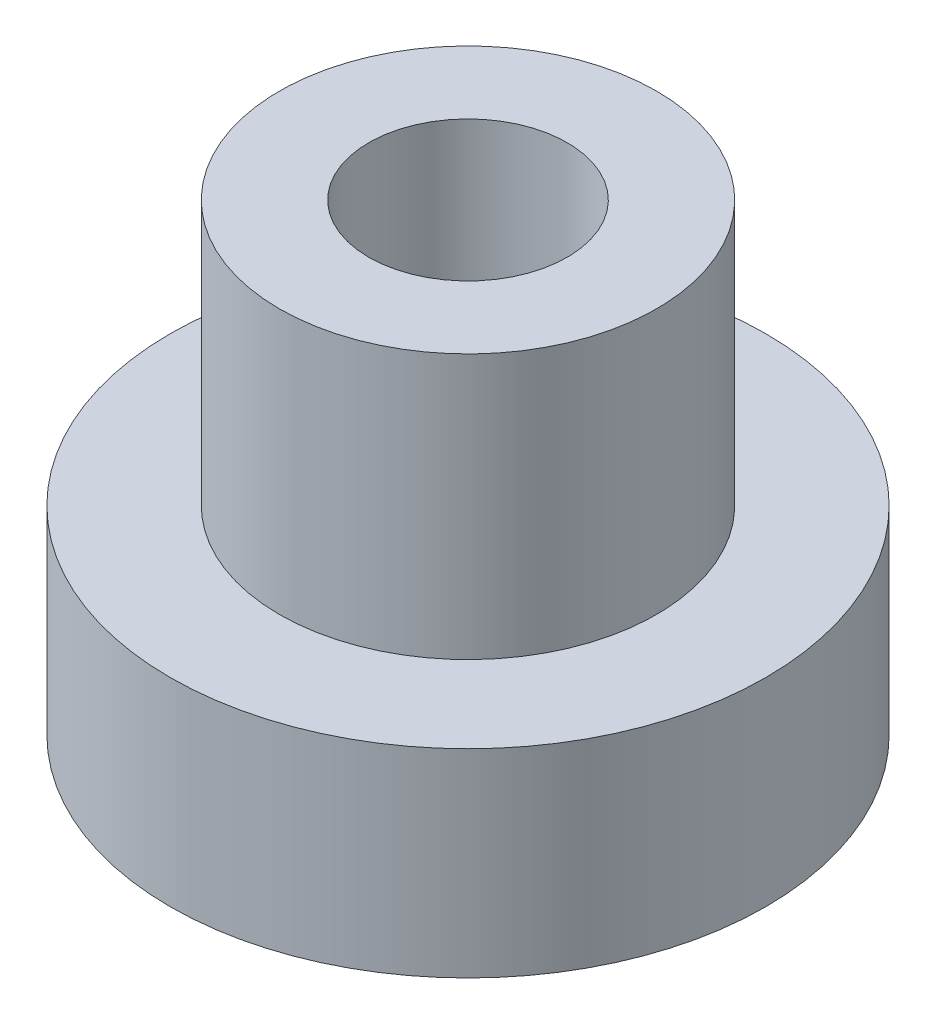
ISO-10303-21;
HEADER;
FILE_DESCRIPTION(('STEP AP214'),'2;1');
FILE_NAME('part.step','',(''),(''),'','','');
FILE_SCHEMA(('AUTOMOTIVE_DESIGN { 1 0 10303 214 1 1 1 1 }'));
ENDSEC;
DATA;
#1=APPLICATION_CONTEXT('core data for automotive mechanical design processes');
#2=APPLICATION_PROTOCOL_DEFINITION('international standard','automotive_design',2000,#1);
#3=PRODUCT_CONTEXT('',#1,'mechanical');
#4=PRODUCT('Part','Part','',(#3));
#5=PRODUCT_RELATED_PRODUCT_CATEGORY('part','',(#4));
#6=PRODUCT_DEFINITION_FORMATION('','',#4);
#7=PRODUCT_DEFINITION_CONTEXT('part definition',#1,'design');
#8=PRODUCT_DEFINITION('design','',#6,#7);
#9=PRODUCT_DEFINITION_SHAPE('','',#8);
#10=(LENGTH_UNIT() NAMED_UNIT(*) SI_UNIT(.MILLI.,.METRE.));
#11=(NAMED_UNIT(*) PLANE_ANGLE_UNIT() SI_UNIT($,.RADIAN.));
#12=(NAMED_UNIT(*) SI_UNIT($,.STERADIAN.) SOLID_ANGLE_UNIT());
#13=UNCERTAINTY_MEASURE_WITH_UNIT(LENGTH_MEASURE(1.E-05),#10,'distance_accuracy_value','');
#14=(GEOMETRIC_REPRESENTATION_CONTEXT(3) GLOBAL_UNCERTAINTY_ASSIGNED_CONTEXT((#13)) GLOBAL_UNIT_ASSIGNED_CONTEXT((#10,
#11,#12)) REPRESENTATION_CONTEXT('',''));
#15=CARTESIAN_POINT('',(0.,0.,0.));
#16=DIRECTION('',(0.,0.,1.));
#17=DIRECTION('',(1.,0.,0.));
#18=AXIS2_PLACEMENT_3D('',#15,#16,#17);
#19=CARTESIAN_POINT('',(0.,3.,0.));
#20=DIRECTION('',(0.,1.,0.));
#21=DIRECTION('',(0.,0.,1.));
#22=AXIS2_PLACEMENT_3D('',#19,#20,#21);
#23=PLANE('',#22);
#24=CARTESIAN_POINT('',(0.,3.,0.));
#25=DIRECTION('',(0.,1.,0.));
#26=DIRECTION('',(0.,0.,1.));
#27=AXIS2_PLACEMENT_3D('',#24,#25,#26);
#28=CIRCLE('',#27,4.5);
#29=CARTESIAN_POINT('',(0.,3.,4.5));
#30=VERTEX_POINT('',#29);
#31=EDGE_CURVE('E10',#30,#30,#28,.T.);
#32=ORIENTED_EDGE('',*,*,#31,.T.);
#33=EDGE_LOOP('',(#32));
#34=FACE_BOUND('',#33,.T.);
#35=CARTESIAN_POINT('',(0.,3.,0.));
#36=DIRECTION('',(0.,1.,0.));
#37=DIRECTION('',(0.,0.,1.));
#38=AXIS2_PLACEMENT_3D('',#35,#36,#37);
#39=CIRCLE('',#38,2.85);
#40=CARTESIAN_POINT('',(0.,3.,2.85));
#41=VERTEX_POINT('',#40);
#42=EDGE_CURVE('E47',#41,#41,#39,.T.);
#43=ORIENTED_EDGE('',*,*,#42,.F.);
#44=EDGE_LOOP('',(#43));
#45=FACE_BOUND('',#44,.T.);
#46=ADVANCED_FACE('F31',(#34,#45),#23,.T.);
#47=CARTESIAN_POINT('',(0.,0.,0.));
#48=DIRECTION('',(0.,1.,0.));
#49=DIRECTION('',(0.,0.,1.));
#50=AXIS2_PLACEMENT_3D('',#47,#48,#49);
#51=PLANE('',#50);
#52=CARTESIAN_POINT('',(0.,0.,0.));
#53=DIRECTION('',(0.,1.,0.));
#54=DIRECTION('',(0.,0.,1.));
#55=AXIS2_PLACEMENT_3D('',#52,#53,#54);
#56=CIRCLE('',#55,4.5);
#57=CARTESIAN_POINT('',(0.,0.,4.5));
#58=VERTEX_POINT('',#57);
#59=EDGE_CURVE('E35',#58,#58,#56,.T.);
#60=ORIENTED_EDGE('',*,*,#59,.F.);
#61=EDGE_LOOP('',(#60));
#62=FACE_BOUND('',#61,.T.);
#63=CARTESIAN_POINT('',(0.,0.,0.));
#64=DIRECTION('',(0.,1.,0.));
#65=DIRECTION('',(0.,0.,1.));
#66=AXIS2_PLACEMENT_3D('',#63,#64,#65);
#67=CIRCLE('',#66,1.5);
#68=CARTESIAN_POINT('',(0.,0.,1.5));
#69=VERTEX_POINT('',#68);
#70=EDGE_CURVE('E42',#69,#69,#67,.T.);
#71=ORIENTED_EDGE('',*,*,#70,.T.);
#72=EDGE_LOOP('',(#71));
#73=FACE_BOUND('',#72,.T.);
#74=ADVANCED_FACE('F72',(#62,#73),#51,.F.);
#75=CARTESIAN_POINT('',(0.,3.,0.));
#76=DIRECTION('',(0.,-1.,0.));
#77=DIRECTION('',(0.,0.,-1.));
#78=AXIS2_PLACEMENT_3D('',#75,#76,#77);
#79=CYLINDRICAL_SURFACE('',#78,4.5);
#80=ORIENTED_EDGE('',*,*,#31,.F.);
#81=EDGE_LOOP('',(#80));
#82=FACE_BOUND('',#81,.T.);
#83=ORIENTED_EDGE('',*,*,#59,.T.);
#84=EDGE_LOOP('',(#83));
#85=FACE_BOUND('',#84,.T.);
#86=ADVANCED_FACE('F33',(#82,#85),#79,.T.);
#87=CARTESIAN_POINT('',(0.,3.,0.));
#88=DIRECTION('',(0.,-1.,0.));
#89=DIRECTION('',(0.,0.,-1.));
#90=AXIS2_PLACEMENT_3D('',#87,#88,#89);
#91=CYLINDRICAL_SURFACE('',#90,1.5);
#92=ORIENTED_EDGE('',*,*,#70,.F.);
#93=EDGE_LOOP('',(#92));
#94=FACE_BOUND('',#93,.T.);
#95=CARTESIAN_POINT('',(0.,7.,0.));
#96=DIRECTION('',(0.,1.,0.));
#97=DIRECTION('',(0.,0.,1.));
#98=AXIS2_PLACEMENT_3D('',#95,#96,#97);
#99=CIRCLE('',#98,1.5);
#100=CARTESIAN_POINT('',(0.,7.,1.5));
#101=VERTEX_POINT('',#100);
#102=EDGE_CURVE('E50',#101,#101,#99,.T.);
#103=ORIENTED_EDGE('',*,*,#102,.T.);
#104=EDGE_LOOP('',(#103));
#105=FACE_BOUND('',#104,.T.);
#106=ADVANCED_FACE('F56',(#94,#105),#91,.F.);
#107=CARTESIAN_POINT('',(0.,7.,0.));
#108=DIRECTION('',(0.,1.,0.));
#109=DIRECTION('',(0.,0.,1.));
#110=AXIS2_PLACEMENT_3D('',#107,#108,#109);
#111=PLANE('',#110);
#112=CARTESIAN_POINT('',(0.,7.,0.));
#113=DIRECTION('',(0.,1.,0.));
#114=DIRECTION('',(0.,0.,1.));
#115=AXIS2_PLACEMENT_3D('',#112,#113,#114);
#116=CIRCLE('',#115,2.85);
#117=CARTESIAN_POINT('',(0.,7.,2.85));
#118=VERTEX_POINT('',#117);
#119=EDGE_CURVE('E46',#118,#118,#116,.T.);
#120=ORIENTED_EDGE('',*,*,#119,.T.);
#121=EDGE_LOOP('',(#120));
#122=FACE_BOUND('',#121,.T.);
#123=ORIENTED_EDGE('',*,*,#102,.F.);
#124=EDGE_LOOP('',(#123));
#125=FACE_BOUND('',#124,.T.);
#126=ADVANCED_FACE('F58',(#122,#125),#111,.T.);
#127=CARTESIAN_POINT('',(0.,7.,0.));
#128=DIRECTION('',(0.,-1.,0.));
#129=DIRECTION('',(0.,0.,-1.));
#130=AXIS2_PLACEMENT_3D('',#127,#128,#129);
#131=CYLINDRICAL_SURFACE('',#130,2.85);
#132=ORIENTED_EDGE('',*,*,#119,.F.);
#133=EDGE_LOOP('',(#132));
#134=FACE_BOUND('',#133,.T.);
#135=ORIENTED_EDGE('',*,*,#42,.T.);
#136=EDGE_LOOP('',(#135));
#137=FACE_BOUND('',#136,.T.);
#138=ADVANCED_FACE('F60',(#134,#137),#131,.T.);
#139=CLOSED_SHELL('',(#46,#74,#86,#106,#126,#138));
#140=MANIFOLD_SOLID_BREP('B2',#139);
#141=ADVANCED_BREP_SHAPE_REPRESENTATION('',(#18,#140),#14);
#142=SHAPE_DEFINITION_REPRESENTATION(#9,#141);
ENDSEC;
END-ISO-10303-21;
